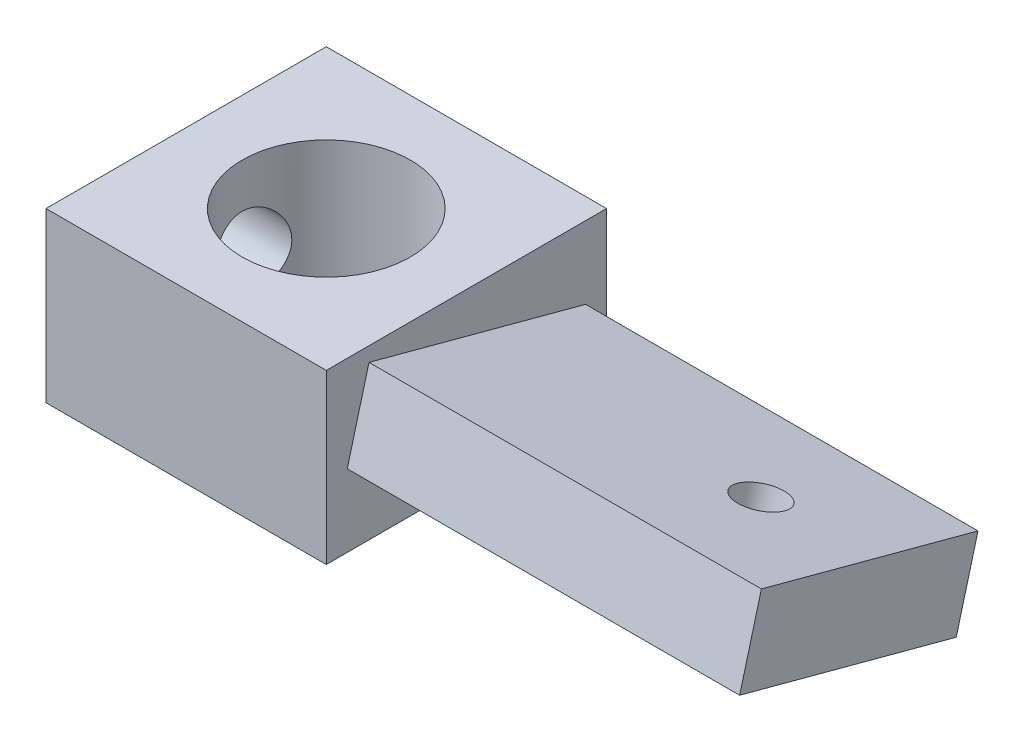
ISO-10303-21;
HEADER;
FILE_DESCRIPTION(('STEP AP214'),'2;1');
FILE_NAME('part.step','',(''),(''),'','','');
FILE_SCHEMA(('AUTOMOTIVE_DESIGN { 1 0 10303 214 1 1 1 1 }'));
ENDSEC;
DATA;
#1=APPLICATION_CONTEXT('core data for automotive mechanical design processes');
#2=APPLICATION_PROTOCOL_DEFINITION('international standard','automotive_design',2000,#1);
#3=PRODUCT_CONTEXT('',#1,'mechanical');
#4=PRODUCT('Part','Part','',(#3));
#5=PRODUCT_RELATED_PRODUCT_CATEGORY('part','',(#4));
#6=PRODUCT_DEFINITION_FORMATION('','',#4);
#7=PRODUCT_DEFINITION_CONTEXT('part definition',#1,'design');
#8=PRODUCT_DEFINITION('design','',#6,#7);
#9=PRODUCT_DEFINITION_SHAPE('','',#8);
#10=(LENGTH_UNIT() NAMED_UNIT(*) SI_UNIT(.MILLI.,.METRE.));
#11=(NAMED_UNIT(*) PLANE_ANGLE_UNIT() SI_UNIT($,.RADIAN.));
#12=(NAMED_UNIT(*) SI_UNIT($,.STERADIAN.) SOLID_ANGLE_UNIT());
#13=UNCERTAINTY_MEASURE_WITH_UNIT(LENGTH_MEASURE(1.E-05),#10,'distance_accuracy_value','');
#14=(GEOMETRIC_REPRESENTATION_CONTEXT(3) GLOBAL_UNCERTAINTY_ASSIGNED_CONTEXT((#13)) GLOBAL_UNIT_ASSIGNED_CONTEXT((#10,
#11,#12)) REPRESENTATION_CONTEXT('',''));
#15=CARTESIAN_POINT('',(0.,0.,0.));
#16=DIRECTION('',(0.,0.,1.));
#17=DIRECTION('',(1.,0.,0.));
#18=AXIS2_PLACEMENT_3D('',#15,#16,#17);
#19=CARTESIAN_POINT('',(7.9375,4.7625,-7.9375));
#20=DIRECTION('',(0.,0.,1.));
#21=DIRECTION('',(0.,-1.,0.));
#22=AXIS2_PLACEMENT_3D('',#19,#20,#21);
#23=PLANE('',#22);
#24=DIRECTION('',(0.,1.,0.));
#25=VECTOR('',#24,1.);
#26=CARTESIAN_POINT('',(-7.9375,4.7625,-7.9375));
#27=LINE('',#26,#25);
#28=CARTESIAN_POINT('',(-7.9375,-4.7625,-7.9375));
#29=VERTEX_POINT('',#28);
#30=CARTESIAN_POINT('',(-7.9375,4.7625,-7.9375));
#31=VERTEX_POINT('',#30);
#32=EDGE_CURVE('E162',#29,#31,#27,.T.);
#33=ORIENTED_EDGE('',*,*,#32,.T.);
#34=DIRECTION('',(-1.,0.,0.));
#35=VECTOR('',#34,1.);
#36=CARTESIAN_POINT('',(7.9375,4.7625,-7.9375));
#37=LINE('',#36,#35);
#38=CARTESIAN_POINT('',(7.9375,4.7625,-7.9375));
#39=VERTEX_POINT('',#38);
#40=EDGE_CURVE('E11',#39,#31,#37,.T.);
#41=ORIENTED_EDGE('',*,*,#40,.F.);
#42=DIRECTION('',(0.,1.,0.));
#43=VECTOR('',#42,1.);
#44=CARTESIAN_POINT('',(7.9375,4.7625,-7.9375));
#45=LINE('',#44,#43);
#46=CARTESIAN_POINT('',(7.9375,-4.7625,-7.9375));
#47=VERTEX_POINT('',#46);
#48=EDGE_CURVE('E163',#47,#39,#45,.T.);
#49=ORIENTED_EDGE('',*,*,#48,.F.);
#50=DIRECTION('',(-1.,0.,0.));
#51=VECTOR('',#50,1.);
#52=CARTESIAN_POINT('',(7.9375,-4.7625,-7.9375));
#53=LINE('',#52,#51);
#54=EDGE_CURVE('E173',#47,#29,#53,.T.);
#55=ORIENTED_EDGE('',*,*,#54,.T.);
#56=EDGE_LOOP('',(#33,#41,#49,#55));
#57=FACE_BOUND('',#56,.T.);
#58=ADVANCED_FACE('F37',(#57),#23,.F.);
#59=CARTESIAN_POINT('',(7.9375,4.7625,7.9375));
#60=DIRECTION('',(0.,-1.,0.));
#61=DIRECTION('',(0.,0.,-1.));
#62=AXIS2_PLACEMENT_3D('',#59,#60,#61);
#63=PLANE('',#62);
#64=CARTESIAN_POINT('',(0.,4.7625,0.));
#65=DIRECTION('',(0.,1.,0.));
#66=DIRECTION('',(0.,0.,1.));
#67=AXIS2_PLACEMENT_3D('',#64,#65,#66);
#68=CIRCLE('',#67,4.7625);
#69=CARTESIAN_POINT('',(0.,4.7625,4.7625));
#70=VERTEX_POINT('',#69);
#71=EDGE_CURVE('E128',#70,#70,#68,.T.);
#72=ORIENTED_EDGE('',*,*,#71,.F.);
#73=EDGE_LOOP('',(#72));
#74=FACE_BOUND('',#73,.T.);
#75=DIRECTION('',(0.,0.,1.));
#76=VECTOR('',#75,1.);
#77=CARTESIAN_POINT('',(-7.9375,4.7625,7.9375));
#78=LINE('',#77,#76);
#79=CARTESIAN_POINT('',(-7.9375,4.7625,7.9375));
#80=VERTEX_POINT('',#79);
#81=EDGE_CURVE('E176',#31,#80,#78,.T.);
#82=ORIENTED_EDGE('',*,*,#81,.T.);
#83=DIRECTION('',(-1.,0.,0.));
#84=VECTOR('',#83,1.);
#85=CARTESIAN_POINT('',(7.9375,4.7625,7.9375));
#86=LINE('',#85,#84);
#87=CARTESIAN_POINT('',(7.9375,4.7625,7.9375));
#88=VERTEX_POINT('',#87);
#89=EDGE_CURVE('E49',#88,#80,#86,.T.);
#90=ORIENTED_EDGE('',*,*,#89,.F.);
#91=DIRECTION('',(0.,0.,1.));
#92=VECTOR('',#91,1.);
#93=CARTESIAN_POINT('',(7.9375,4.7625,7.9375));
#94=LINE('',#93,#92);
#95=EDGE_CURVE('E166',#39,#88,#94,.T.);
#96=ORIENTED_EDGE('',*,*,#95,.F.);
#97=ORIENTED_EDGE('',*,*,#40,.T.);
#98=EDGE_LOOP('',(#82,#90,#96,#97));
#99=FACE_BOUND('',#98,.T.);
#100=ADVANCED_FACE('F209',(#74,#99),#63,.F.);
#101=CARTESIAN_POINT('',(7.9375,4.7625,7.9375));
#102=DIRECTION('',(0.,0.,-1.));
#103=DIRECTION('',(0.,1.,0.));
#104=AXIS2_PLACEMENT_3D('',#101,#102,#103);
#105=PLANE('',#104);
#106=DIRECTION('',(0.,-1.,0.));
#107=VECTOR('',#106,1.);
#108=CARTESIAN_POINT('',(-7.9375,4.7625,7.9375));
#109=LINE('',#108,#107);
#110=CARTESIAN_POINT('',(-7.9375,-4.7625,7.9375));
#111=VERTEX_POINT('',#110);
#112=EDGE_CURVE('E178',#80,#111,#109,.T.);
#113=ORIENTED_EDGE('',*,*,#112,.T.);
#114=DIRECTION('',(-1.,0.,0.));
#115=VECTOR('',#114,1.);
#116=CARTESIAN_POINT('',(7.9375,-4.7625,7.9375));
#117=LINE('',#116,#115);
#118=CARTESIAN_POINT('',(7.9375,-4.7625,7.9375));
#119=VERTEX_POINT('',#118);
#120=EDGE_CURVE('E183',#119,#111,#117,.T.);
#121=ORIENTED_EDGE('',*,*,#120,.F.);
#122=DIRECTION('',(0.,-1.,0.));
#123=VECTOR('',#122,1.);
#124=CARTESIAN_POINT('',(7.9375,4.7625,7.9375));
#125=LINE('',#124,#123);
#126=EDGE_CURVE('E169',#88,#119,#125,.T.);
#127=ORIENTED_EDGE('',*,*,#126,.F.);
#128=ORIENTED_EDGE('',*,*,#89,.T.);
#129=EDGE_LOOP('',(#113,#121,#127,#128));
#130=FACE_BOUND('',#129,.T.);
#131=ADVANCED_FACE('F214',(#130),#105,.F.);
#132=CARTESIAN_POINT('',(7.9375,-4.7625,7.9375));
#133=DIRECTION('',(0.,1.,0.));
#134=DIRECTION('',(0.,0.,1.));
#135=AXIS2_PLACEMENT_3D('',#132,#133,#134);
#136=PLANE('',#135);
#137=CARTESIAN_POINT('',(0.,-4.7625,0.));
#138=DIRECTION('',(0.,1.,0.));
#139=DIRECTION('',(0.,0.,1.));
#140=AXIS2_PLACEMENT_3D('',#137,#138,#139);
#141=CIRCLE('',#140,4.7625);
#142=CARTESIAN_POINT('',(0.,-4.7625,4.7625));
#143=VERTEX_POINT('',#142);
#144=EDGE_CURVE('E131',#143,#143,#141,.T.);
#145=ORIENTED_EDGE('',*,*,#144,.T.);
#146=EDGE_LOOP('',(#145));
#147=FACE_BOUND('',#146,.T.);
#148=DIRECTION('',(0.,0.,-1.));
#149=VECTOR('',#148,1.);
#150=CARTESIAN_POINT('',(-7.9375,-4.7625,7.9375));
#151=LINE('',#150,#149);
#152=EDGE_CURVE('E167',#111,#29,#151,.T.);
#153=ORIENTED_EDGE('',*,*,#152,.T.);
#154=ORIENTED_EDGE('',*,*,#54,.F.);
#155=DIRECTION('',(0.,0.,-1.));
#156=VECTOR('',#155,1.);
#157=CARTESIAN_POINT('',(7.9375,-4.7625,7.9375));
#158=LINE('',#157,#156);
#159=EDGE_CURVE('E171',#119,#47,#158,.T.);
#160=ORIENTED_EDGE('',*,*,#159,.F.);
#161=ORIENTED_EDGE('',*,*,#120,.T.);
#162=EDGE_LOOP('',(#153,#154,#160,#161));
#163=FACE_BOUND('',#162,.T.);
#164=ADVANCED_FACE('F232',(#147,#163),#136,.F.);
#165=CARTESIAN_POINT('',(7.9375,0.,0.));
#166=DIRECTION('',(1.,0.,0.));
#167=DIRECTION('',(0.,0.,-1.));
#168=AXIS2_PLACEMENT_3D('',#165,#166,#167);
#169=PLANE('',#168);
#170=DIRECTION('',(0.,-0.965925826289068,0.258819045102521));
#171=VECTOR('',#170,1.);
#172=CARTESIAN_POINT('',(7.9375,-0.656609937449832,6.74994184808596));
#173=LINE('',#172,#171);
#174=CARTESIAN_POINT('',(7.9375,3.94361181025186,5.5173161457852));
#175=VERTEX_POINT('',#174);
#176=CARTESIAN_POINT('',(7.9375,-0.656609937449832,6.74994184808596));
#177=VERTEX_POINT('',#176);
#178=EDGE_CURVE('E57',#175,#177,#173,.T.);
#179=ORIENTED_EDGE('',*,*,#178,.F.);
#180=DIRECTION('',(0.,0.258819045102521,0.965925826289068));
#181=VECTOR('',#180,1.);
#182=CARTESIAN_POINT('',(7.9375,3.94361181025186,5.5173161457852));
#183=LINE('',#182,#181);
#184=CARTESIAN_POINT('',(7.9375,0.656609937449834,-6.74994184808596));
#185=VERTEX_POINT('',#184);
#186=EDGE_CURVE('E61',#185,#175,#183,.T.);
#187=ORIENTED_EDGE('',*,*,#186,.F.);
#188=DIRECTION('',(0.,0.965925826289068,-0.258819045102521));
#189=VECTOR('',#188,1.);
#190=CARTESIAN_POINT('',(7.9375,-3.94361181025185,-5.51731614578521));
#191=LINE('',#190,#189);
#192=CARTESIAN_POINT('',(7.9375,-3.94361181025185,-5.51731614578521));
#193=VERTEX_POINT('',#192);
#194=EDGE_CURVE('E148',#193,#185,#191,.T.);
#195=ORIENTED_EDGE('',*,*,#194,.F.);
#196=DIRECTION('',(0.,-0.258819045102521,-0.965925826289068));
#197=VECTOR('',#196,1.);
#198=CARTESIAN_POINT('',(7.9375,-0.656609937449832,6.74994184808596));
#199=LINE('',#198,#197);
#200=EDGE_CURVE('E145',#177,#193,#199,.T.);
#201=ORIENTED_EDGE('',*,*,#200,.F.);
#202=EDGE_LOOP('',(#179,#187,#195,#201));
#203=FACE_BOUND('',#202,.T.);
#204=ORIENTED_EDGE('',*,*,#48,.T.);
#205=ORIENTED_EDGE('',*,*,#95,.T.);
#206=ORIENTED_EDGE('',*,*,#126,.T.);
#207=ORIENTED_EDGE('',*,*,#159,.T.);
#208=EDGE_LOOP('',(#204,#205,#206,#207));
#209=FACE_BOUND('',#208,.T.);
#210=ADVANCED_FACE('F228',(#203,#209),#169,.T.);
#211=CARTESIAN_POINT('',(-7.9375,0.,0.));
#212=DIRECTION('',(1.,0.,0.));
#213=DIRECTION('',(0.,0.,-1.));
#214=AXIS2_PLACEMENT_3D('',#211,#212,#213);
#215=PLANE('',#214);
#216=CARTESIAN_POINT('',(-7.9375,0.,0.));
#217=DIRECTION('',(-1.,0.,0.));
#218=DIRECTION('',(0.,0.,1.));
#219=AXIS2_PLACEMENT_3D('',#216,#217,#218);
#220=CIRCLE('',#219,2.24789999999999);
#221=CARTESIAN_POINT('',(-7.9375,0.,2.24789999999999));
#222=VERTEX_POINT('',#221);
#223=EDGE_CURVE('E116',#222,#222,#220,.T.);
#224=ORIENTED_EDGE('',*,*,#223,.F.);
#225=EDGE_LOOP('',(#224));
#226=FACE_BOUND('',#225,.T.);
#227=ORIENTED_EDGE('',*,*,#32,.F.);
#228=ORIENTED_EDGE('',*,*,#152,.F.);
#229=ORIENTED_EDGE('',*,*,#112,.F.);
#230=ORIENTED_EDGE('',*,*,#81,.F.);
#231=EDGE_LOOP('',(#227,#228,#229,#230));
#232=FACE_BOUND('',#231,.T.);
#233=ADVANCED_FACE('F222',(#226,#232),#215,.F.);
#234=CARTESIAN_POINT('',(30.1625,-0.656609937449832,6.74994184808596));
#235=DIRECTION('',(0.,-0.258819045102521,-0.965925826289068));
#236=DIRECTION('',(0.,0.965925826289068,-0.258819045102521));
#237=AXIS2_PLACEMENT_3D('',#234,#235,#236);
#238=PLANE('',#237);
#239=ORIENTED_EDGE('',*,*,#178,.T.);
#240=DIRECTION('',(-1.,0.,0.));
#241=VECTOR('',#240,1.);
#242=CARTESIAN_POINT('',(30.1625,-0.656609937449832,6.74994184808596));
#243=LINE('',#242,#241);
#244=CARTESIAN_POINT('',(30.1625,-0.656609937449832,6.74994184808596));
#245=VERTEX_POINT('',#244);
#246=EDGE_CURVE('E159',#245,#177,#243,.T.);
#247=ORIENTED_EDGE('',*,*,#246,.F.);
#248=DIRECTION('',(0.,-0.965925826289068,0.258819045102521));
#249=VECTOR('',#248,1.);
#250=CARTESIAN_POINT('',(30.1625,-0.656609937449832,6.74994184808596));
#251=LINE('',#250,#249);
#252=CARTESIAN_POINT('',(30.1625,3.94361181025186,5.5173161457852));
#253=VERTEX_POINT('',#252);
#254=EDGE_CURVE('E134',#253,#245,#251,.T.);
#255=ORIENTED_EDGE('',*,*,#254,.F.);
#256=DIRECTION('',(-1.,0.,0.));
#257=VECTOR('',#256,1.);
#258=CARTESIAN_POINT('',(30.1625,3.94361181025186,5.5173161457852));
#259=LINE('',#258,#257);
#260=EDGE_CURVE('E143',#253,#175,#259,.T.);
#261=ORIENTED_EDGE('',*,*,#260,.T.);
#262=EDGE_LOOP('',(#239,#247,#255,#261));
#263=FACE_BOUND('',#262,.T.);
#264=ADVANCED_FACE('F244',(#263),#238,.F.);
#265=CARTESIAN_POINT('',(30.1625,-0.656609937449832,6.74994184808596));
#266=DIRECTION('',(0.,0.965925826289068,-0.258819045102521));
#267=DIRECTION('',(0.,0.258819045102521,0.965925826289068));
#268=AXIS2_PLACEMENT_3D('',#265,#266,#267);
#269=PLANE('',#268);
#270=CARTESIAN_POINT('',(24.,-2.30011087385084,0.616312851150379));
#271=DIRECTION('',(0.,0.965925826289068,-0.258819045102521));
#272=DIRECTION('',(0.,0.258819045102521,0.965925826289068));
#273=AXIS2_PLACEMENT_3D('',#270,#271,#272);
#274=CIRCLE('',#273,1.35255);
#275=CARTESIAN_POINT('',(24.,-1.95004517439743,1.92277582749766));
#276=VERTEX_POINT('',#275);
#277=EDGE_CURVE('E125',#276,#276,#274,.T.);
#278=ORIENTED_EDGE('',*,*,#277,.T.);
#279=EDGE_LOOP('',(#278));
#280=FACE_BOUND('',#279,.T.);
#281=ORIENTED_EDGE('',*,*,#200,.T.);
#282=DIRECTION('',(-1.,0.,0.));
#283=VECTOR('',#282,1.);
#284=CARTESIAN_POINT('',(30.1625,-3.94361181025185,-5.51731614578521));
#285=LINE('',#284,#283);
#286=CARTESIAN_POINT('',(30.1625,-3.94361181025185,-5.51731614578521));
#287=VERTEX_POINT('',#286);
#288=EDGE_CURVE('E156',#287,#193,#285,.T.);
#289=ORIENTED_EDGE('',*,*,#288,.F.);
#290=DIRECTION('',(0.,-0.258819045102521,-0.965925826289068));
#291=VECTOR('',#290,1.);
#292=CARTESIAN_POINT('',(30.1625,-0.656609937449832,6.74994184808596));
#293=LINE('',#292,#291);
#294=EDGE_CURVE('E137',#245,#287,#293,.T.);
#295=ORIENTED_EDGE('',*,*,#294,.F.);
#296=ORIENTED_EDGE('',*,*,#246,.T.);
#297=EDGE_LOOP('',(#281,#289,#295,#296));
#298=FACE_BOUND('',#297,.T.);
#299=ADVANCED_FACE('F250',(#280,#298),#269,.F.);
#300=CARTESIAN_POINT('',(30.1625,-3.94361181025185,-5.51731614578521));
#301=DIRECTION('',(0.,0.258819045102521,0.965925826289068));
#302=DIRECTION('',(0.,-0.965925826289068,0.258819045102521));
#303=AXIS2_PLACEMENT_3D('',#300,#301,#302);
#304=PLANE('',#303);
#305=ORIENTED_EDGE('',*,*,#194,.T.);
#306=DIRECTION('',(-1.,0.,0.));
#307=VECTOR('',#306,1.);
#308=CARTESIAN_POINT('',(30.1625,0.656609937449834,-6.74994184808596));
#309=LINE('',#308,#307);
#310=CARTESIAN_POINT('',(30.1625,0.656609937449834,-6.74994184808596));
#311=VERTEX_POINT('',#310);
#312=EDGE_CURVE('E153',#311,#185,#309,.T.);
#313=ORIENTED_EDGE('',*,*,#312,.F.);
#314=DIRECTION('',(0.,0.965925826289068,-0.258819045102521));
#315=VECTOR('',#314,1.);
#316=CARTESIAN_POINT('',(30.1625,-3.94361181025185,-5.51731614578521));
#317=LINE('',#316,#315);
#318=EDGE_CURVE('E139',#287,#311,#317,.T.);
#319=ORIENTED_EDGE('',*,*,#318,.F.);
#320=ORIENTED_EDGE('',*,*,#288,.T.);
#321=EDGE_LOOP('',(#305,#313,#319,#320));
#322=FACE_BOUND('',#321,.T.);
#323=ADVANCED_FACE('F254',(#322),#304,.F.);
#324=CARTESIAN_POINT('',(30.1625,3.94361181025186,5.5173161457852));
#325=DIRECTION('',(0.,-0.965925826289068,0.258819045102521));
#326=DIRECTION('',(0.,-0.258819045102521,-0.965925826289068));
#327=AXIS2_PLACEMENT_3D('',#324,#325,#326);
#328=PLANE('',#327);
#329=CARTESIAN_POINT('',(24.,2.30011087385085,-0.61631285115038));
#330=DIRECTION('',(0.,0.965925826289068,-0.258819045102521));
#331=DIRECTION('',(0.,0.258819045102521,0.965925826289068));
#332=AXIS2_PLACEMENT_3D('',#329,#330,#331);
#333=CIRCLE('',#332,1.35255);
#334=CARTESIAN_POINT('',(24.,2.65017657330426,0.690150125196897));
#335=VERTEX_POINT('',#334);
#336=EDGE_CURVE('E122',#335,#335,#333,.T.);
#337=ORIENTED_EDGE('',*,*,#336,.F.);
#338=EDGE_LOOP('',(#337));
#339=FACE_BOUND('',#338,.T.);
#340=ORIENTED_EDGE('',*,*,#186,.T.);
#341=ORIENTED_EDGE('',*,*,#260,.F.);
#342=DIRECTION('',(0.,0.258819045102521,0.965925826289068));
#343=VECTOR('',#342,1.);
#344=CARTESIAN_POINT('',(30.1625,3.94361181025186,5.5173161457852));
#345=LINE('',#344,#343);
#346=EDGE_CURVE('E141',#311,#253,#345,.T.);
#347=ORIENTED_EDGE('',*,*,#346,.F.);
#348=ORIENTED_EDGE('',*,*,#312,.T.);
#349=EDGE_LOOP('',(#340,#341,#347,#348));
#350=FACE_BOUND('',#349,.T.);
#351=ADVANCED_FACE('F258',(#339,#350),#328,.F.);
#352=CARTESIAN_POINT('',(30.1625,0.,0.));
#353=DIRECTION('',(-1.,0.,0.));
#354=DIRECTION('',(0.,0.,1.));
#355=AXIS2_PLACEMENT_3D('',#352,#353,#354);
#356=PLANE('',#355);
#357=ORIENTED_EDGE('',*,*,#254,.T.);
#358=ORIENTED_EDGE('',*,*,#294,.T.);
#359=ORIENTED_EDGE('',*,*,#318,.T.);
#360=ORIENTED_EDGE('',*,*,#346,.T.);
#361=EDGE_LOOP('',(#357,#358,#359,#360));
#362=FACE_BOUND('',#361,.T.);
#363=ADVANCED_FACE('F205',(#362),#356,.F.);
#364=CARTESIAN_POINT('',(0.,4.7625,0.));
#365=DIRECTION('',(0.,1.,0.));
#366=DIRECTION('',(0.,0.,1.));
#367=AXIS2_PLACEMENT_3D('',#364,#365,#366);
#368=CYLINDRICAL_SURFACE('',#367,4.7625);
#369=CARTESIAN_POINT('',(4.19861308529376,0.,2.24789999999999));
#370=CARTESIAN_POINT('',(4.19862249091289,-0.118118481294714,2.24789181497888));
#371=CARTESIAN_POINT('',(4.20367214224818,-0.236412425111539,2.23852858653616));
#372=CARTESIAN_POINT('',(4.22316850474107,-0.469446139709448,2.20151438475507));
#373=CARTESIAN_POINT('',(4.23763711247826,-0.584176974427003,2.17382079566228));
#374=CARTESIAN_POINT('',(4.27393122539513,-0.806286379881757,2.10155399760349));
#375=CARTESIAN_POINT('',(4.29572086949579,-0.913697776953764,2.05706293976653));
#376=CARTESIAN_POINT('',(4.34414741880936,-1.11950576523274,1.95271273917773));
#377=CARTESIAN_POINT('',(4.37078411020242,-1.21790275380837,1.89285427428699));
#378=CARTESIAN_POINT('',(4.42828964982113,-1.41084884360532,1.75432990117537));
#379=CARTESIAN_POINT('',(4.4593255242748,-1.50459131858942,1.67460927709398));
#380=CARTESIAN_POINT('',(4.52077718484575,-1.67799211516013,1.50082460405354));
#381=CARTESIAN_POINT('',(4.55119268340161,-1.7576440309937,1.40675406744162));
#382=CARTESIAN_POINT('',(4.61010738879662,-1.9051454926395,1.20020605426121));
#383=CARTESIAN_POINT('',(4.63839054995195,-1.97203257748666,1.08697390316203));
#384=CARTESIAN_POINT('',(4.68773078803815,-2.08544592985778,0.849281718509149));
#385=CARTESIAN_POINT('',(4.70879193875019,-2.13198368009529,0.724828064969657));
#386=CARTESIAN_POINT('',(4.74011882538127,-2.20028034255304,0.476745837388787));
#387=CARTESIAN_POINT('',(4.75099386818153,-2.22344532741637,0.353582978112197));
#388=CARTESIAN_POINT('',(4.76297618474054,-2.24893868979987,0.104673352061637));
#389=CARTESIAN_POINT('',(4.76408864737485,-2.25127813624017,-0.0210720064676428));
#390=CARTESIAN_POINT('',(4.75673460586145,-2.23566630388711,-0.261131665261092));
#391=CARTESIAN_POINT('',(4.74900567898985,-2.21927750708775,-0.37557499081737));
#392=CARTESIAN_POINT('',(4.72591637257168,-2.16942851201335,-0.599861895149592));
#393=CARTESIAN_POINT('',(4.71055542581193,-2.13596704488918,-0.709705131388002));
#394=CARTESIAN_POINT('',(4.67335008925639,-2.05262168218517,-0.923679449526057));
#395=CARTESIAN_POINT('',(4.651413165976,-2.00250220948285,-1.02770201593274));
#396=CARTESIAN_POINT('',(4.60309279406096,-1.88754575958309,-1.22612682574247));
#397=CARTESIAN_POINT('',(4.57670771775394,-1.82270339194671,-1.32052552720724));
#398=CARTESIAN_POINT('',(4.51933295577913,-1.67366345558621,-1.50573237494063));
#399=CARTESIAN_POINT('',(4.4881423879336,-1.58827613833331,-1.59552193139409));
#400=CARTESIAN_POINT('',(4.42622548797348,-1.40380461726946,-1.76002130421824));
#401=CARTESIAN_POINT('',(4.39549945727478,-1.30471191097931,-1.83472168831093));
#402=CARTESIAN_POINT('',(4.33632003762494,-1.08929930310118,-1.97066505052382));
#403=CARTESIAN_POINT('',(4.30806673809416,-0.972353022799948,-2.03101080186286));
#404=CARTESIAN_POINT('',(4.25964082543052,-0.728295573998269,-2.13072105624348));
#405=CARTESIAN_POINT('',(4.23946062279932,-0.601194087911856,-2.17010527673416));
#406=CARTESIAN_POINT('',(4.21153017330155,-0.350612646254451,-2.22379770254718));
#407=CARTESIAN_POINT('',(4.20295549965102,-0.227585432263304,-2.23977668041779));
#408=CARTESIAN_POINT('',(4.19684440078847,0.0196646665722651,-2.25121281160198));
#409=CARTESIAN_POINT('',(4.19930191427621,0.143886857443926,-2.24668123380633));
#410=CARTESIAN_POINT('',(4.2141095919221,0.377843116867826,-2.21875716961038));
#411=CARTESIAN_POINT('',(4.22552698703587,0.487857179766401,-2.19714175422016));
#412=CARTESIAN_POINT('',(4.25565434202101,0.70253324924823,-2.13820001664318));
#413=CARTESIAN_POINT('',(4.27436637848892,0.807193722196461,-2.10086922045026));
#414=CARTESIAN_POINT('',(4.31800481243186,1.01364616053473,-2.00970085029928));
#415=CARTESIAN_POINT('',(4.34317821242157,1.11508265994286,-1.95518081293246));
#416=CARTESIAN_POINT('',(4.3966379381465,1.30792765813733,-1.83180197698763));
#417=CARTESIAN_POINT('',(4.42492581224806,1.39933112347959,-1.76293603100073));
#418=CARTESIAN_POINT('',(4.48516453938102,1.579994756124,-1.60396022973717));
#419=CARTESIAN_POINT('',(4.51717666481139,1.66791864595043,-1.51234832518817));
#420=CARTESIAN_POINT('',(4.57850211198277,1.82750193667469,-1.31506260895287));
#421=CARTESIAN_POINT('',(4.60781481674683,1.89915762478501,-1.20938559598857));
#422=CARTESIAN_POINT('',(4.66110088709735,2.02504828254234,-0.984430612049278));
#423=CARTESIAN_POINT('',(4.6849792264359,2.07897960685939,-0.864958689105622));
#424=CARTESIAN_POINT('',(4.72399798755313,2.16548088009911,-0.617192742114927));
#425=CARTESIAN_POINT('',(4.7391452305841,2.19806750749154,-0.488905692913194));
#426=CARTESIAN_POINT('',(4.75801392678254,2.238443340852,-0.238908472452705));
#427=CARTESIAN_POINT('',(4.7625959564458,2.24810232872932,-0.117564117965144));
#428=CARTESIAN_POINT('',(4.76240108872293,2.24769141076204,0.125067336575224));
#429=CARTESIAN_POINT('',(4.75762679365395,2.23762699067856,0.246354443165813));
#430=CARTESIAN_POINT('',(4.73975282287431,2.19935557956275,0.478521327066676));
#431=CARTESIAN_POINT('',(4.72712042279907,2.17216586383807,0.58960825320107));
#432=CARTESIAN_POINT('',(4.69515437678638,2.10169129774853,0.805512746818199));
#433=CARTESIAN_POINT('',(4.67581966264637,2.0584038816815,0.91032931181789));
#434=CARTESIAN_POINT('',(4.6311507872383,1.95486107434739,1.11598462857149));
#435=CARTESIAN_POINT('',(4.60558539028933,1.89392851244823,1.21643082209084));
#436=CARTESIAN_POINT('',(4.55126467553495,1.75771437339154,1.40611029069201));
#437=CARTESIAN_POINT('',(4.52250791268611,1.68242628491194,1.49533844694884));
#438=CARTESIAN_POINT('',(4.46171949453939,1.51178406373345,1.66841635350608));
#439=CARTESIAN_POINT('',(4.42962476523885,1.41523822769083,1.75107365201167));
#440=CARTESIAN_POINT('',(4.36810022742863,1.20898693424088,1.89935919522541));
#441=CARTESIAN_POINT('',(4.33867238161829,1.09927192078046,1.96497496338686));
#442=CARTESIAN_POINT('',(4.28570017089656,0.867043105203765,2.07802209650814));
#443=CARTESIAN_POINT('',(4.2622577870744,0.744352185427539,2.12514478657287));
#444=CARTESIAN_POINT('',(4.23465130163608,0.554843738781553,2.17934164183534));
#445=CARTESIAN_POINT('',(4.22671250368338,0.490823789435473,2.19465285224498));
#446=CARTESIAN_POINT('',(4.21365093510047,0.361424788576058,2.21962965089574));
#447=CARTESIAN_POINT('',(4.20852612050073,0.296046759439442,2.22929933724351));
#448=CARTESIAN_POINT('',(4.2028313014641,0.192089554840007,2.240007519657));
#449=CARTESIAN_POINT('',(4.20125262902779,0.153750957334812,2.24296470262666));
#450=CARTESIAN_POINT('',(4.19914196233958,0.0769477856537817,2.24691232578839));
#451=CARTESIAN_POINT('',(4.19861002092681,0.0384832052164787,2.24790266669401));
#452=CARTESIAN_POINT('',(4.19861308529376,0.,2.24789999999999));
#453=B_SPLINE_CURVE_WITH_KNOTS('',3,(#369,#370,#371,#372,#373,#374,#375,#376,#377,#378,#379,
#380,#381,#382,#383,#384,#385,#386,#387,#388,#389,#390,#391,#392,#393,#394,#395,#396,#397,#398,
#399,#400,#401,#402,#403,#404,#405,#406,#407,#408,#409,#410,#411,#412,#413,#414,#415,#416,#417,
#418,#419,#420,#421,#422,#423,#424,#425,#426,#427,#428,#429,#430,#431,#432,#433,#434,#435,#436,
#437,#438,#439,#440,#441,#442,#443,#444,#445,#446,#447,#448,#449,#450,#451,#452),.UNSPECIFIED.,
.T.,.F.,(4,2,2,2,2,2,2,2,2,2,2,2,2,2,2,2,2,2,2,2,2,2,2,2,2,2,2,2,2,2,2,2,2,2,2,2,2,2,2,2,2,4),
(0.,0.354200783522453,0.709227944820233,1.06254081140708,1.4158380959304,1.7949527019368,
2.17423921795996,2.57570382225799,2.97694159502121,3.35226861836156,3.72739614083089,
4.0733759430646,4.41938146243136,4.77050460306402,5.12175650699897,5.50342152346633,
5.88532438632852,6.28700430556901,6.68830571409167,7.05926620082768,7.43002289954001,
7.7666038679282,8.10328072230145,8.45549994594948,8.80789507352046,9.19896699553885,
9.59012807987813,9.98767794615521,10.3849168003641,10.7484431574967,11.1118684197408,
11.4555132370662,11.7992128490755,12.1584123134921,12.5177750913995,12.9092392673185,
13.3009892415166,13.699025112222,13.8976770441864,14.0961844914872,14.2115778935968,
14.3269771206333),.UNSPECIFIED.);
#454=CARTESIAN_POINT('',(4.19861308529376,0.,2.24789999999999));
#455=VERTEX_POINT('',#454);
#456=EDGE_CURVE('E40',#455,#455,#453,.T.);
#457=ORIENTED_EDGE('',*,*,#456,.T.);
#458=EDGE_LOOP('',(#457));
#459=FACE_BOUND('',#458,.T.);
#460=CARTESIAN_POINT('',(-4.19861308529376,0.,2.24789999999999));
#461=CARTESIAN_POINT('',(-4.19862249091289,0.118118481294714,2.24789181497888));
#462=CARTESIAN_POINT('',(-4.20367214224818,0.236412425111539,2.23852858653616));
#463=CARTESIAN_POINT('',(-4.22316850474107,0.469446139709448,2.20151438475507));
#464=CARTESIAN_POINT('',(-4.23763711247826,0.584176974427003,2.17382079566228));
#465=CARTESIAN_POINT('',(-4.27393122539513,0.806286379881757,2.10155399760349));
#466=CARTESIAN_POINT('',(-4.29572086949579,0.913697776953764,2.05706293976653));
#467=CARTESIAN_POINT('',(-4.34414741880936,1.11950576523274,1.95271273917773));
#468=CARTESIAN_POINT('',(-4.37078411020242,1.21790275380837,1.89285427428699));
#469=CARTESIAN_POINT('',(-4.42828964982113,1.41084884360532,1.75432990117537));
#470=CARTESIAN_POINT('',(-4.4593255242748,1.50459131858942,1.67460927709398));
#471=CARTESIAN_POINT('',(-4.52077718484575,1.67799211516013,1.50082460405354));
#472=CARTESIAN_POINT('',(-4.55119268340161,1.7576440309937,1.40675406744162));
#473=CARTESIAN_POINT('',(-4.61010738879662,1.9051454926395,1.20020605426121));
#474=CARTESIAN_POINT('',(-4.63839054995195,1.97203257748666,1.08697390316203));
#475=CARTESIAN_POINT('',(-4.68773078803815,2.08544592985778,0.849281718509149));
#476=CARTESIAN_POINT('',(-4.70879193875019,2.13198368009529,0.724828064969657));
#477=CARTESIAN_POINT('',(-4.74011882538127,2.20028034255304,0.476745837388787));
#478=CARTESIAN_POINT('',(-4.75099386818153,2.22344532741637,0.353582978112197));
#479=CARTESIAN_POINT('',(-4.76297618474054,2.24893868979987,0.104673352061637));
#480=CARTESIAN_POINT('',(-4.76408864737485,2.25127813624017,-0.0210720064676428));
#481=CARTESIAN_POINT('',(-4.75673460586145,2.23566630388711,-0.261131665261092));
#482=CARTESIAN_POINT('',(-4.74900567898985,2.21927750708775,-0.37557499081737));
#483=CARTESIAN_POINT('',(-4.72591637257168,2.16942851201335,-0.599861895149592));
#484=CARTESIAN_POINT('',(-4.71055542581193,2.13596704488918,-0.709705131388002));
#485=CARTESIAN_POINT('',(-4.67335008925639,2.05262168218517,-0.923679449526057));
#486=CARTESIAN_POINT('',(-4.651413165976,2.00250220948285,-1.02770201593274));
#487=CARTESIAN_POINT('',(-4.60309279406096,1.88754575958309,-1.22612682574247));
#488=CARTESIAN_POINT('',(-4.57670771775394,1.82270339194671,-1.32052552720724));
#489=CARTESIAN_POINT('',(-4.51933295577913,1.67366345558621,-1.50573237494063));
#490=CARTESIAN_POINT('',(-4.4881423879336,1.58827613833331,-1.59552193139409));
#491=CARTESIAN_POINT('',(-4.42622548797348,1.40380461726946,-1.76002130421824));
#492=CARTESIAN_POINT('',(-4.39549945727478,1.30471191097931,-1.83472168831093));
#493=CARTESIAN_POINT('',(-4.33632003762494,1.08929930310118,-1.97066505052382));
#494=CARTESIAN_POINT('',(-4.30806673809416,0.972353022799948,-2.03101080186286));
#495=CARTESIAN_POINT('',(-4.25964082543052,0.728295573998269,-2.13072105624348));
#496=CARTESIAN_POINT('',(-4.23946062279932,0.601194087911856,-2.17010527673416));
#497=CARTESIAN_POINT('',(-4.21153017330155,0.350612646254451,-2.22379770254718));
#498=CARTESIAN_POINT('',(-4.20295549965102,0.227585432263304,-2.23977668041779));
#499=CARTESIAN_POINT('',(-4.19684440078847,-0.0196646665722651,-2.25121281160198));
#500=CARTESIAN_POINT('',(-4.19930191427621,-0.143886857443926,-2.24668123380633));
#501=CARTESIAN_POINT('',(-4.2141095919221,-0.377843116867826,-2.21875716961038));
#502=CARTESIAN_POINT('',(-4.22552698703587,-0.487857179766401,-2.19714175422016));
#503=CARTESIAN_POINT('',(-4.25565434202101,-0.70253324924823,-2.13820001664318));
#504=CARTESIAN_POINT('',(-4.27436637848892,-0.807193722196461,-2.10086922045026));
#505=CARTESIAN_POINT('',(-4.31800481243186,-1.01364616053473,-2.00970085029928));
#506=CARTESIAN_POINT('',(-4.34317821242157,-1.11508265994286,-1.95518081293246));
#507=CARTESIAN_POINT('',(-4.3966379381465,-1.30792765813733,-1.83180197698763));
#508=CARTESIAN_POINT('',(-4.42492581224806,-1.39933112347959,-1.76293603100073));
#509=CARTESIAN_POINT('',(-4.48516453938102,-1.579994756124,-1.60396022973717));
#510=CARTESIAN_POINT('',(-4.51717666481139,-1.66791864595043,-1.51234832518817));
#511=CARTESIAN_POINT('',(-4.57850211198277,-1.82750193667469,-1.31506260895287));
#512=CARTESIAN_POINT('',(-4.60781481674683,-1.89915762478501,-1.20938559598857));
#513=CARTESIAN_POINT('',(-4.66110088709735,-2.02504828254234,-0.984430612049278));
#514=CARTESIAN_POINT('',(-4.6849792264359,-2.07897960685939,-0.864958689105622));
#515=CARTESIAN_POINT('',(-4.72399798755313,-2.16548088009911,-0.617192742114927));
#516=CARTESIAN_POINT('',(-4.7391452305841,-2.19806750749154,-0.488905692913194));
#517=CARTESIAN_POINT('',(-4.75801392678254,-2.238443340852,-0.238908472452705));
#518=CARTESIAN_POINT('',(-4.7625959564458,-2.24810232872932,-0.117564117965144));
#519=CARTESIAN_POINT('',(-4.76240108872293,-2.24769141076204,0.125067336575224));
#520=CARTESIAN_POINT('',(-4.75762679365395,-2.23762699067856,0.246354443165813));
#521=CARTESIAN_POINT('',(-4.73975282287431,-2.19935557956275,0.478521327066676));
#522=CARTESIAN_POINT('',(-4.72712042279907,-2.17216586383807,0.58960825320107));
#523=CARTESIAN_POINT('',(-4.69515437678638,-2.10169129774853,0.805512746818199));
#524=CARTESIAN_POINT('',(-4.67581966264637,-2.0584038816815,0.91032931181789));
#525=CARTESIAN_POINT('',(-4.6311507872383,-1.95486107434739,1.11598462857149));
#526=CARTESIAN_POINT('',(-4.60558539028933,-1.89392851244823,1.21643082209084));
#527=CARTESIAN_POINT('',(-4.55126467553495,-1.75771437339154,1.40611029069201));
#528=CARTESIAN_POINT('',(-4.52250791268611,-1.68242628491194,1.49533844694884));
#529=CARTESIAN_POINT('',(-4.46171949453939,-1.51178406373345,1.66841635350608));
#530=CARTESIAN_POINT('',(-4.42962476523885,-1.41523822769083,1.75107365201167));
#531=CARTESIAN_POINT('',(-4.36810022742863,-1.20898693424088,1.89935919522541));
#532=CARTESIAN_POINT('',(-4.33867238161829,-1.09927192078046,1.96497496338686));
#533=CARTESIAN_POINT('',(-4.28570017089656,-0.867043105203765,2.07802209650814));
#534=CARTESIAN_POINT('',(-4.2622577870744,-0.744352185427539,2.12514478657287));
#535=CARTESIAN_POINT('',(-4.23465130163608,-0.554843738781553,2.17934164183534));
#536=CARTESIAN_POINT('',(-4.22671250368338,-0.490823789435473,2.19465285224498));
#537=CARTESIAN_POINT('',(-4.21365093510047,-0.361424788576058,2.21962965089574));
#538=CARTESIAN_POINT('',(-4.20852612050073,-0.296046759439442,2.22929933724351));
#539=CARTESIAN_POINT('',(-4.2028313014641,-0.192089554840007,2.240007519657));
#540=CARTESIAN_POINT('',(-4.20125262902779,-0.153750957334812,2.24296470262666));
#541=CARTESIAN_POINT('',(-4.19914196233958,-0.0769477856537817,2.24691232578839));
#542=CARTESIAN_POINT('',(-4.19861002092681,-0.0384832052164787,2.24790266669401));
#543=CARTESIAN_POINT('',(-4.19861308529376,0.,2.24789999999999));
#544=B_SPLINE_CURVE_WITH_KNOTS('',3,(#460,#461,#462,#463,#464,#465,#466,#467,#468,#469,#470,
#471,#472,#473,#474,#475,#476,#477,#478,#479,#480,#481,#482,#483,#484,#485,#486,#487,#488,#489,
#490,#491,#492,#493,#494,#495,#496,#497,#498,#499,#500,#501,#502,#503,#504,#505,#506,#507,#508,
#509,#510,#511,#512,#513,#514,#515,#516,#517,#518,#519,#520,#521,#522,#523,#524,#525,#526,#527,
#528,#529,#530,#531,#532,#533,#534,#535,#536,#537,#538,#539,#540,#541,#542,#543),.UNSPECIFIED.,
.T.,.F.,(4,2,2,2,2,2,2,2,2,2,2,2,2,2,2,2,2,2,2,2,2,2,2,2,2,2,2,2,2,2,2,2,2,2,2,2,2,2,2,2,2,4),
(0.,0.354200783522453,0.709227944820233,1.06254081140708,1.4158380959304,1.7949527019368,
2.17423921795996,2.57570382225799,2.97694159502121,3.35226861836156,3.72739614083089,
4.0733759430646,4.41938146243136,4.77050460306402,5.12175650699897,5.50342152346633,
5.88532438632852,6.28700430556901,6.68830571409167,7.05926620082768,7.43002289954001,
7.7666038679282,8.10328072230145,8.45549994594948,8.80789507352046,9.19896699553885,
9.59012807987813,9.98767794615521,10.3849168003641,10.7484431574967,11.1118684197408,
11.4555132370662,11.7992128490755,12.1584123134921,12.5177750913995,12.9092392673185,
13.3009892415166,13.699025112222,13.8976770441864,14.0961844914872,14.2115778935968,
14.3269771206333),.UNSPECIFIED.);
#545=CARTESIAN_POINT('',(-4.19861308529376,0.,2.24789999999999));
#546=VERTEX_POINT('',#545);
#547=EDGE_CURVE('E115',#546,#546,#544,.T.);
#548=ORIENTED_EDGE('',*,*,#547,.T.);
#549=EDGE_LOOP('',(#548));
#550=FACE_BOUND('',#549,.T.);
#551=ORIENTED_EDGE('',*,*,#144,.F.);
#552=EDGE_LOOP('',(#551));
#553=FACE_BOUND('',#552,.T.);
#554=ORIENTED_EDGE('',*,*,#71,.T.);
#555=EDGE_LOOP('',(#554));
#556=FACE_BOUND('',#555,.T.);
#557=ADVANCED_FACE('F189',(#459,#550,#553,#556),#368,.F.);
#558=CARTESIAN_POINT('',(24.,2.30011087385085,-0.61631285115038));
#559=DIRECTION('',(0.,0.965925826289068,-0.258819045102521));
#560=DIRECTION('',(0.,0.258819045102521,0.965925826289068));
#561=AXIS2_PLACEMENT_3D('',#558,#559,#560);
#562=CYLINDRICAL_SURFACE('',#561,1.35255);
#563=ORIENTED_EDGE('',*,*,#336,.T.);
#564=EDGE_LOOP('',(#563));
#565=FACE_BOUND('',#564,.T.);
#566=ORIENTED_EDGE('',*,*,#277,.F.);
#567=EDGE_LOOP('',(#566));
#568=FACE_BOUND('',#567,.T.);
#569=ADVANCED_FACE('F197',(#565,#568),#562,.F.);
#570=CARTESIAN_POINT('',(-7.9375,0.,0.));
#571=DIRECTION('',(-1.,0.,0.));
#572=DIRECTION('',(0.,0.,1.));
#573=AXIS2_PLACEMENT_3D('',#570,#571,#572);
#574=CYLINDRICAL_SURFACE('',#573,2.24789999999999);
#575=ORIENTED_EDGE('',*,*,#223,.T.);
#576=EDGE_LOOP('',(#575));
#577=FACE_BOUND('',#576,.T.);
#578=ORIENTED_EDGE('',*,*,#547,.F.);
#579=EDGE_LOOP('',(#578));
#580=FACE_BOUND('',#579,.T.);
#581=ADVANCED_FACE('F195',(#577,#580),#574,.F.);
#582=CARTESIAN_POINT('',(11.1125,0.,0.));
#583=DIRECTION('',(-1.,0.,0.));
#584=DIRECTION('',(0.,0.,1.));
#585=AXIS2_PLACEMENT_3D('',#582,#583,#584);
#586=CIRCLE('',#585,2.2479);
#587=CARTESIAN_POINT('',(11.1125,0.,2.2479));
#588=VERTEX_POINT('',#587);
#589=EDGE_CURVE('E113',#588,#588,#586,.T.);
#590=ORIENTED_EDGE('',*,*,#589,.F.);
#591=EDGE_LOOP('',(#590));
#592=FACE_BOUND('',#591,.T.);
#593=ORIENTED_EDGE('',*,*,#456,.F.);
#594=EDGE_LOOP('',(#593));
#595=FACE_BOUND('',#594,.T.);
#596=ADVANCED_FACE('F109',(#592,#595),#574,.F.);
#597=CARTESIAN_POINT('',(11.1125,0.,0.));
#598=DIRECTION('',(-1.,0.,0.));
#599=DIRECTION('',(0.,0.,1.));
#600=AXIS2_PLACEMENT_3D('',#597,#598,#599);
#601=CONICAL_SURFACE('',#600,2.2479,1.02974425867665);
#602=CARTESIAN_POINT('',(12.4631745855121,0.,0.));
#603=VERTEX_POINT('',#602);
#604=VERTEX_LOOP('',#603);
#605=FACE_BOUND('',#604,.T.);
#606=ORIENTED_EDGE('',*,*,#589,.T.);
#607=EDGE_LOOP('',(#606));
#608=FACE_BOUND('',#607,.T.);
#609=ADVANCED_FACE('F106',(#605,#608),#601,.F.);
#610=CLOSED_SHELL('',(#58,#100,#131,#164,#210,#233,#264,#299,#323,#351,#363,#557,#569,#581,#596,#609));
#611=MANIFOLD_SOLID_BREP('B2',#610);
#612=ADVANCED_BREP_SHAPE_REPRESENTATION('',(#18,#611),#14);
#613=SHAPE_DEFINITION_REPRESENTATION(#9,#612);
ENDSEC;
END-ISO-10303-21;
